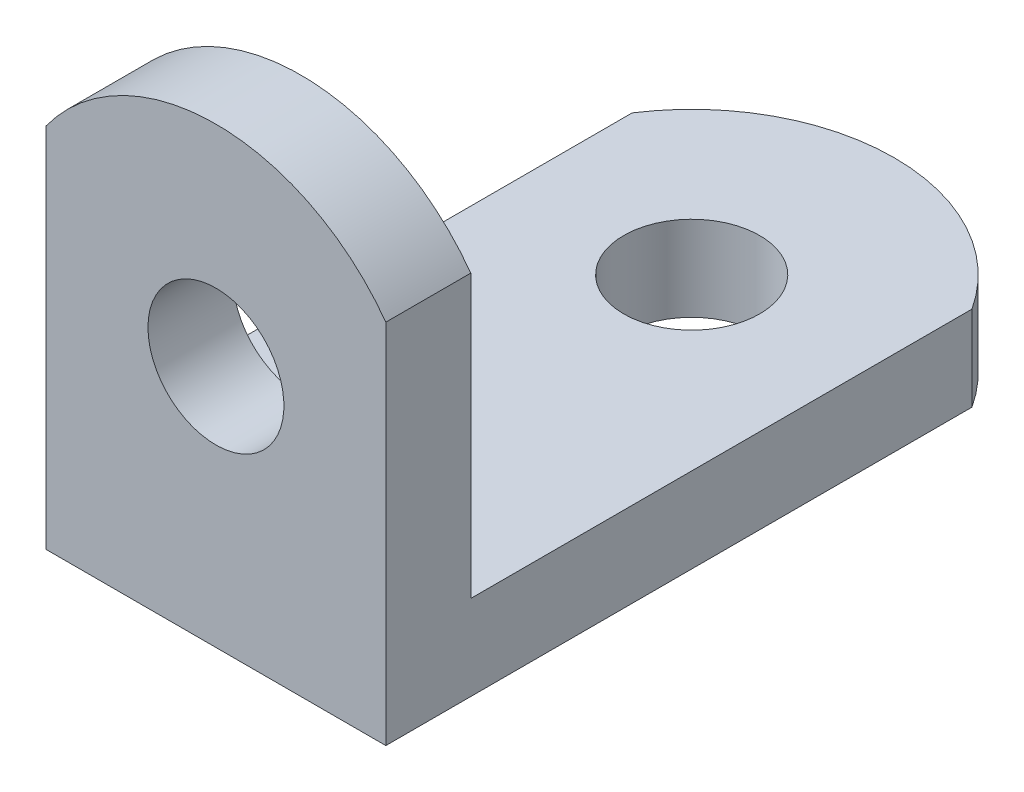
ISO-10303-21;
HEADER;
FILE_DESCRIPTION(('STEP AP214'),'2;1');
FILE_NAME('part.step','',(''),(''),'','','');
FILE_SCHEMA(('AUTOMOTIVE_DESIGN { 1 0 10303 214 1 1 1 1 }'));
ENDSEC;
DATA;
#1=APPLICATION_CONTEXT('core data for automotive mechanical design processes');
#2=APPLICATION_PROTOCOL_DEFINITION('international standard','automotive_design',2000,#1);
#3=PRODUCT_CONTEXT('',#1,'mechanical');
#4=PRODUCT('Part','Part','',(#3));
#5=PRODUCT_RELATED_PRODUCT_CATEGORY('part','',(#4));
#6=PRODUCT_DEFINITION_FORMATION('','',#4);
#7=PRODUCT_DEFINITION_CONTEXT('part definition',#1,'design');
#8=PRODUCT_DEFINITION('design','',#6,#7);
#9=PRODUCT_DEFINITION_SHAPE('','',#8);
#10=(LENGTH_UNIT() NAMED_UNIT(*) SI_UNIT(.MILLI.,.METRE.));
#11=(NAMED_UNIT(*) PLANE_ANGLE_UNIT() SI_UNIT($,.RADIAN.));
#12=(NAMED_UNIT(*) SI_UNIT($,.STERADIAN.) SOLID_ANGLE_UNIT());
#13=UNCERTAINTY_MEASURE_WITH_UNIT(LENGTH_MEASURE(1.E-05),#10,'distance_accuracy_value','');
#14=(GEOMETRIC_REPRESENTATION_CONTEXT(3) GLOBAL_UNCERTAINTY_ASSIGNED_CONTEXT((#13)) GLOBAL_UNIT_ASSIGNED_CONTEXT((#10,
#11,#12)) REPRESENTATION_CONTEXT('',''));
#15=CARTESIAN_POINT('',(0.,0.,0.));
#16=DIRECTION('',(0.,0.,1.));
#17=DIRECTION('',(1.,0.,0.));
#18=AXIS2_PLACEMENT_3D('',#15,#16,#17);
#19=CARTESIAN_POINT('',(0.,3.175,0.));
#20=DIRECTION('',(0.,-1.,0.));
#21=DIRECTION('',(0.,0.,-1.));
#22=AXIS2_PLACEMENT_3D('',#19,#20,#21);
#23=PLANE('',#22);
#24=CARTESIAN_POINT('',(-19.1117942942341,3.175,2.7394214876033));
#25=DIRECTION('',(0.,1.,0.));
#26=DIRECTION('',(0.,0.,1.));
#27=AXIS2_PLACEMENT_3D('',#24,#25,#26);
#28=CIRCLE('',#27,2.54);
#29=CARTESIAN_POINT('',(-19.1117942942341,3.175,5.27942148760331));
#30=VERTEX_POINT('',#29);
#31=EDGE_CURVE('E125',#30,#30,#28,.T.);
#32=ORIENTED_EDGE('',*,*,#31,.F.);
#33=EDGE_LOOP('',(#32));
#34=FACE_BOUND('',#33,.T.);
#35=DIRECTION('',(0.,0.,-1.));
#36=VECTOR('',#35,1.);
#37=CARTESIAN_POINT('',(-12.7617942942341,3.175,20.5194214876033));
#38=LINE('',#37,#36);
#39=CARTESIAN_POINT('',(-12.7617942942341,3.175,17.3444214876033));
#40=VERTEX_POINT('',#39);
#41=CARTESIAN_POINT('',(-12.7617942942341,3.175,-1.3851271011667));
#42=VERTEX_POINT('',#41);
#43=EDGE_CURVE('E107',#40,#42,#38,.T.);
#44=ORIENTED_EDGE('',*,*,#43,.T.);
#45=CARTESIAN_POINT('',(-19.1117942942341,3.175,2.7394214876033));
#46=DIRECTION('',(0.,-1.,0.));
#47=DIRECTION('',(0.,0.,1.));
#48=AXIS2_PLACEMENT_3D('',#45,#46,#47);
#49=CIRCLE('',#48,7.57194830021472);
#50=CARTESIAN_POINT('',(-25.4617942942341,3.175,-1.3851271011667));
#51=VERTEX_POINT('',#50);
#52=EDGE_CURVE('E134',#51,#42,#49,.T.);
#53=ORIENTED_EDGE('',*,*,#52,.F.);
#54=DIRECTION('',(0.,0.,1.));
#55=VECTOR('',#54,1.);
#56=CARTESIAN_POINT('',(-25.4617942942341,3.175,20.5194214876033));
#57=LINE('',#56,#55);
#58=CARTESIAN_POINT('',(-25.4617942942341,3.175,17.3444214876033));
#59=VERTEX_POINT('',#58);
#60=EDGE_CURVE('E105',#51,#59,#57,.T.);
#61=ORIENTED_EDGE('',*,*,#60,.T.);
#62=DIRECTION('',(-1.,0.,0.));
#63=VECTOR('',#62,1.);
#64=CARTESIAN_POINT('',(-25.4617942942341,3.175,17.3444214876033));
#65=LINE('',#64,#63);
#66=EDGE_CURVE('E121',#40,#59,#65,.T.);
#67=ORIENTED_EDGE('',*,*,#66,.F.);
#68=EDGE_LOOP('',(#44,#53,#61,#67));
#69=FACE_BOUND('',#68,.T.);
#70=ADVANCED_FACE('F35',(#34,#69),#23,.F.);
#71=CARTESIAN_POINT('',(0.,0.,0.));
#72=DIRECTION('',(0.,-1.,0.));
#73=DIRECTION('',(0.,0.,-1.));
#74=AXIS2_PLACEMENT_3D('',#71,#72,#73);
#75=PLANE('',#74);
#76=CARTESIAN_POINT('',(-19.1117942942341,0.,2.7394214876033));
#77=DIRECTION('',(0.,1.,0.));
#78=DIRECTION('',(0.,0.,1.));
#79=AXIS2_PLACEMENT_3D('',#76,#77,#78);
#80=CIRCLE('',#79,2.54);
#81=CARTESIAN_POINT('',(-19.1117942942341,0.,5.27942148760331));
#82=VERTEX_POINT('',#81);
#83=EDGE_CURVE('E124',#82,#82,#80,.T.);
#84=ORIENTED_EDGE('',*,*,#83,.T.);
#85=EDGE_LOOP('',(#84));
#86=FACE_BOUND('',#85,.T.);
#87=CARTESIAN_POINT('',(-19.1117942942341,0.,2.7394214876033));
#88=DIRECTION('',(0.,-1.,0.));
#89=DIRECTION('',(0.,0.,1.));
#90=AXIS2_PLACEMENT_3D('',#87,#88,#89);
#91=CIRCLE('',#90,7.57194830021472);
#92=CARTESIAN_POINT('',(-25.4617942942341,0.,-1.3851271011667));
#93=VERTEX_POINT('',#92);
#94=CARTESIAN_POINT('',(-12.7617942942341,0.,-1.3851271011667));
#95=VERTEX_POINT('',#94);
#96=EDGE_CURVE('E132',#93,#95,#91,.T.);
#97=ORIENTED_EDGE('',*,*,#96,.T.);
#98=DIRECTION('',(0.,0.,-1.));
#99=VECTOR('',#98,1.);
#100=CARTESIAN_POINT('',(-12.7617942942341,0.,20.5194214876033));
#101=LINE('',#100,#99);
#102=CARTESIAN_POINT('',(-12.7617942942341,0.,20.5194214876033));
#103=VERTEX_POINT('',#102);
#104=EDGE_CURVE('E114',#103,#95,#101,.T.);
#105=ORIENTED_EDGE('',*,*,#104,.F.);
#106=DIRECTION('',(1.,0.,0.));
#107=VECTOR('',#106,1.);
#108=CARTESIAN_POINT('',(-25.4617942942341,0.,20.5194214876033));
#109=LINE('',#108,#107);
#110=CARTESIAN_POINT('',(-25.4617942942341,0.,20.5194214876033));
#111=VERTEX_POINT('',#110);
#112=EDGE_CURVE('E103',#111,#103,#109,.T.);
#113=ORIENTED_EDGE('',*,*,#112,.F.);
#114=DIRECTION('',(0.,0.,1.));
#115=VECTOR('',#114,1.);
#116=CARTESIAN_POINT('',(-25.4617942942341,0.,20.5194214876033));
#117=LINE('',#116,#115);
#118=EDGE_CURVE('E111',#93,#111,#117,.T.);
#119=ORIENTED_EDGE('',*,*,#118,.F.);
#120=EDGE_LOOP('',(#97,#105,#113,#119));
#121=FACE_BOUND('',#120,.T.);
#122=ADVANCED_FACE('F154',(#86,#121),#75,.T.);
#123=CARTESIAN_POINT('',(-12.7617942942341,3.175,20.5194214876033));
#124=DIRECTION('',(-1.,0.,0.));
#125=DIRECTION('',(0.,0.,1.));
#126=AXIS2_PLACEMENT_3D('',#123,#124,#125);
#127=PLANE('',#126);
#128=DIRECTION('',(0.,-1.,0.));
#129=VECTOR('',#128,1.);
#130=CARTESIAN_POINT('',(-12.7617942942341,16.9672,17.3444214876033));
#131=LINE('',#130,#129);
#132=CARTESIAN_POINT('',(-12.7617942942341,13.7043779032103,17.3444214876033));
#133=VERTEX_POINT('',#132);
#134=EDGE_CURVE('E99',#133,#40,#131,.T.);
#135=ORIENTED_EDGE('',*,*,#134,.F.);
#136=DIRECTION('',(0.,0.,-1.));
#137=VECTOR('',#136,1.);
#138=CARTESIAN_POINT('',(-12.7617942942341,13.7043779032103,20.5194214876033));
#139=LINE('',#138,#137);
#140=CARTESIAN_POINT('',(-12.7617942942341,13.7043779032103,20.5194214876033));
#141=VERTEX_POINT('',#140);
#142=EDGE_CURVE('E50',#141,#133,#139,.T.);
#143=ORIENTED_EDGE('',*,*,#142,.F.);
#144=DIRECTION('',(0.,-1.,0.));
#145=VECTOR('',#144,1.);
#146=CARTESIAN_POINT('',(-12.7617942942341,3.175,20.5194214876033));
#147=LINE('',#146,#145);
#148=EDGE_CURVE('E43',#141,#103,#147,.T.);
#149=ORIENTED_EDGE('',*,*,#148,.T.);
#150=ORIENTED_EDGE('',*,*,#104,.T.);
#151=DIRECTION('',(0.,1.,0.));
#152=VECTOR('',#151,1.);
#153=CARTESIAN_POINT('',(-12.7617942942341,0.,-1.3851271011667));
#154=LINE('',#153,#152);
#155=EDGE_CURVE('E58',#95,#42,#154,.T.);
#156=ORIENTED_EDGE('',*,*,#155,.T.);
#157=ORIENTED_EDGE('',*,*,#43,.F.);
#158=EDGE_LOOP('',(#135,#143,#149,#150,#156,#157));
#159=FACE_BOUND('',#158,.T.);
#160=ADVANCED_FACE('F37',(#159),#127,.F.);
#161=CARTESIAN_POINT('',(-25.4617942942341,3.175,20.5194214876033));
#162=DIRECTION('',(1.,0.,0.));
#163=DIRECTION('',(0.,0.,-1.));
#164=AXIS2_PLACEMENT_3D('',#161,#162,#163);
#165=PLANE('',#164);
#166=DIRECTION('',(0.,-1.,0.));
#167=VECTOR('',#166,1.);
#168=CARTESIAN_POINT('',(-25.4617942942341,3.175,20.5194214876033));
#169=LINE('',#168,#167);
#170=CARTESIAN_POINT('',(-25.4617942942341,13.7043779032103,20.5194214876033));
#171=VERTEX_POINT('',#170);
#172=EDGE_CURVE('E11',#171,#111,#169,.T.);
#173=ORIENTED_EDGE('',*,*,#172,.F.);
#174=DIRECTION('',(0.,0.,-1.));
#175=VECTOR('',#174,1.);
#176=CARTESIAN_POINT('',(-25.4617942942341,13.7043779032103,20.5194214876033));
#177=LINE('',#176,#175);
#178=CARTESIAN_POINT('',(-25.4617942942341,13.7043779032103,17.3444214876033));
#179=VERTEX_POINT('',#178);
#180=EDGE_CURVE('E88',#171,#179,#177,.T.);
#181=ORIENTED_EDGE('',*,*,#180,.T.);
#182=DIRECTION('',(0.,-1.,0.));
#183=VECTOR('',#182,1.);
#184=CARTESIAN_POINT('',(-25.4617942942341,16.9672,17.3444214876033));
#185=LINE('',#184,#183);
#186=EDGE_CURVE('E119',#179,#59,#185,.T.);
#187=ORIENTED_EDGE('',*,*,#186,.T.);
#188=ORIENTED_EDGE('',*,*,#60,.F.);
#189=DIRECTION('',(0.,1.,0.));
#190=VECTOR('',#189,1.);
#191=CARTESIAN_POINT('',(-25.4617942942341,0.,-1.3851271011667));
#192=LINE('',#191,#190);
#193=EDGE_CURVE('E130',#93,#51,#192,.T.);
#194=ORIENTED_EDGE('',*,*,#193,.F.);
#195=ORIENTED_EDGE('',*,*,#118,.T.);
#196=EDGE_LOOP('',(#173,#181,#187,#188,#194,#195));
#197=FACE_BOUND('',#196,.T.);
#198=ADVANCED_FACE('F147',(#197),#165,.F.);
#199=CARTESIAN_POINT('',(-25.4617942942341,3.175,20.5194214876033));
#200=DIRECTION('',(0.,0.,-1.));
#201=DIRECTION('',(-1.,0.,0.));
#202=AXIS2_PLACEMENT_3D('',#199,#200,#201);
#203=PLANE('',#202);
#204=CARTESIAN_POINT('',(-19.1117942942341,9.0932,20.5194214876033));
#205=DIRECTION('',(0.,0.,-1.));
#206=DIRECTION('',(-1.,0.,0.));
#207=AXIS2_PLACEMENT_3D('',#204,#205,#206);
#208=CIRCLE('',#207,2.54);
#209=CARTESIAN_POINT('',(-21.6517942942341,9.0932,20.5194214876033));
#210=VERTEX_POINT('',#209);
#211=EDGE_CURVE('E136',#210,#210,#208,.T.);
#212=ORIENTED_EDGE('',*,*,#211,.T.);
#213=EDGE_LOOP('',(#212));
#214=FACE_BOUND('',#213,.T.);
#215=ORIENTED_EDGE('',*,*,#148,.F.);
#216=CARTESIAN_POINT('',(-19.1117942942341,9.0932,20.5194214876033));
#217=DIRECTION('',(0.,0.,1.));
#218=DIRECTION('',(-1.,0.,0.));
#219=AXIS2_PLACEMENT_3D('',#216,#217,#218);
#220=CIRCLE('',#219,7.84764051515198);
#221=EDGE_CURVE('E85',#141,#171,#220,.T.);
#222=ORIENTED_EDGE('',*,*,#221,.T.);
#223=ORIENTED_EDGE('',*,*,#172,.T.);
#224=ORIENTED_EDGE('',*,*,#112,.T.);
#225=EDGE_LOOP('',(#215,#222,#223,#224));
#226=FACE_BOUND('',#225,.T.);
#227=ADVANCED_FACE('F101',(#214,#226),#203,.F.);
#228=CARTESIAN_POINT('',(-25.4617942942341,16.9672,17.3444214876033));
#229=DIRECTION('',(0.,0.,1.));
#230=DIRECTION('',(1.,0.,0.));
#231=AXIS2_PLACEMENT_3D('',#228,#229,#230);
#232=PLANE('',#231);
#233=CARTESIAN_POINT('',(-19.1117942942341,9.0932,17.3444214876033));
#234=DIRECTION('',(0.,0.,-1.));
#235=DIRECTION('',(-1.,0.,0.));
#236=AXIS2_PLACEMENT_3D('',#233,#234,#235);
#237=CIRCLE('',#236,2.54);
#238=CARTESIAN_POINT('',(-21.6517942942341,9.0932,17.3444214876033));
#239=VERTEX_POINT('',#238);
#240=EDGE_CURVE('E138',#239,#239,#237,.T.);
#241=ORIENTED_EDGE('',*,*,#240,.F.);
#242=EDGE_LOOP('',(#241));
#243=FACE_BOUND('',#242,.T.);
#244=ORIENTED_EDGE('',*,*,#186,.F.);
#245=CARTESIAN_POINT('',(-19.1117942942341,9.0932,17.3444214876033));
#246=DIRECTION('',(0.,0.,1.));
#247=DIRECTION('',(-1.,0.,0.));
#248=AXIS2_PLACEMENT_3D('',#245,#246,#247);
#249=CIRCLE('',#248,7.84764051515198);
#250=EDGE_CURVE('E92',#133,#179,#249,.T.);
#251=ORIENTED_EDGE('',*,*,#250,.F.);
#252=ORIENTED_EDGE('',*,*,#134,.T.);
#253=ORIENTED_EDGE('',*,*,#66,.T.);
#254=EDGE_LOOP('',(#244,#251,#252,#253));
#255=FACE_BOUND('',#254,.T.);
#256=ADVANCED_FACE('F149',(#243,#255),#232,.F.);
#257=CARTESIAN_POINT('',(-19.1117942942341,0.,2.7394214876033));
#258=DIRECTION('',(0.,1.,0.));
#259=DIRECTION('',(0.,0.,1.));
#260=AXIS2_PLACEMENT_3D('',#257,#258,#259);
#261=CYLINDRICAL_SURFACE('',#260,2.54);
#262=ORIENTED_EDGE('',*,*,#83,.F.);
#263=EDGE_LOOP('',(#262));
#264=FACE_BOUND('',#263,.T.);
#265=ORIENTED_EDGE('',*,*,#31,.T.);
#266=EDGE_LOOP('',(#265));
#267=FACE_BOUND('',#266,.T.);
#268=ADVANCED_FACE('F160',(#264,#267),#261,.F.);
#269=CARTESIAN_POINT('',(-19.1117942942341,0.,2.7394214876033));
#270=DIRECTION('',(0.,1.,0.));
#271=DIRECTION('',(0.,0.,1.));
#272=AXIS2_PLACEMENT_3D('',#269,#270,#271);
#273=CYLINDRICAL_SURFACE('',#272,7.57194830021472);
#274=ORIENTED_EDGE('',*,*,#52,.T.);
#275=ORIENTED_EDGE('',*,*,#155,.F.);
#276=ORIENTED_EDGE('',*,*,#96,.F.);
#277=ORIENTED_EDGE('',*,*,#193,.T.);
#278=EDGE_LOOP('',(#274,#275,#276,#277));
#279=FACE_BOUND('',#278,.T.);
#280=ADVANCED_FACE('F157',(#279),#273,.T.);
#281=CARTESIAN_POINT('',(-19.1117942942341,9.0932,20.5194214876033));
#282=DIRECTION('',(0.,0.,-1.));
#283=DIRECTION('',(-1.,0.,0.));
#284=AXIS2_PLACEMENT_3D('',#281,#282,#283);
#285=CYLINDRICAL_SURFACE('',#284,2.54);
#286=ORIENTED_EDGE('',*,*,#211,.F.);
#287=EDGE_LOOP('',(#286));
#288=FACE_BOUND('',#287,.T.);
#289=ORIENTED_EDGE('',*,*,#240,.T.);
#290=EDGE_LOOP('',(#289));
#291=FACE_BOUND('',#290,.T.);
#292=ADVANCED_FACE('F159',(#288,#291),#285,.F.);
#293=CARTESIAN_POINT('',(-19.1117942942341,9.0932,20.5194214876033));
#294=DIRECTION('',(0.,0.,-1.));
#295=DIRECTION('',(-1.,0.,0.));
#296=AXIS2_PLACEMENT_3D('',#293,#294,#295);
#297=CYLINDRICAL_SURFACE('',#296,7.84764051515198);
#298=ORIENTED_EDGE('',*,*,#250,.T.);
#299=ORIENTED_EDGE('',*,*,#180,.F.);
#300=ORIENTED_EDGE('',*,*,#221,.F.);
#301=ORIENTED_EDGE('',*,*,#142,.T.);
#302=EDGE_LOOP('',(#298,#299,#300,#301));
#303=FACE_BOUND('',#302,.T.);
#304=ADVANCED_FACE('F86',(#303),#297,.T.);
#305=CLOSED_SHELL('',(#70,#122,#160,#198,#227,#256,#268,#280,#292,#304));
#306=MANIFOLD_SOLID_BREP('B2',#305);
#307=ADVANCED_BREP_SHAPE_REPRESENTATION('',(#18,#306),#14);
#308=SHAPE_DEFINITION_REPRESENTATION(#9,#307);
ENDSEC;
END-ISO-10303-21;
